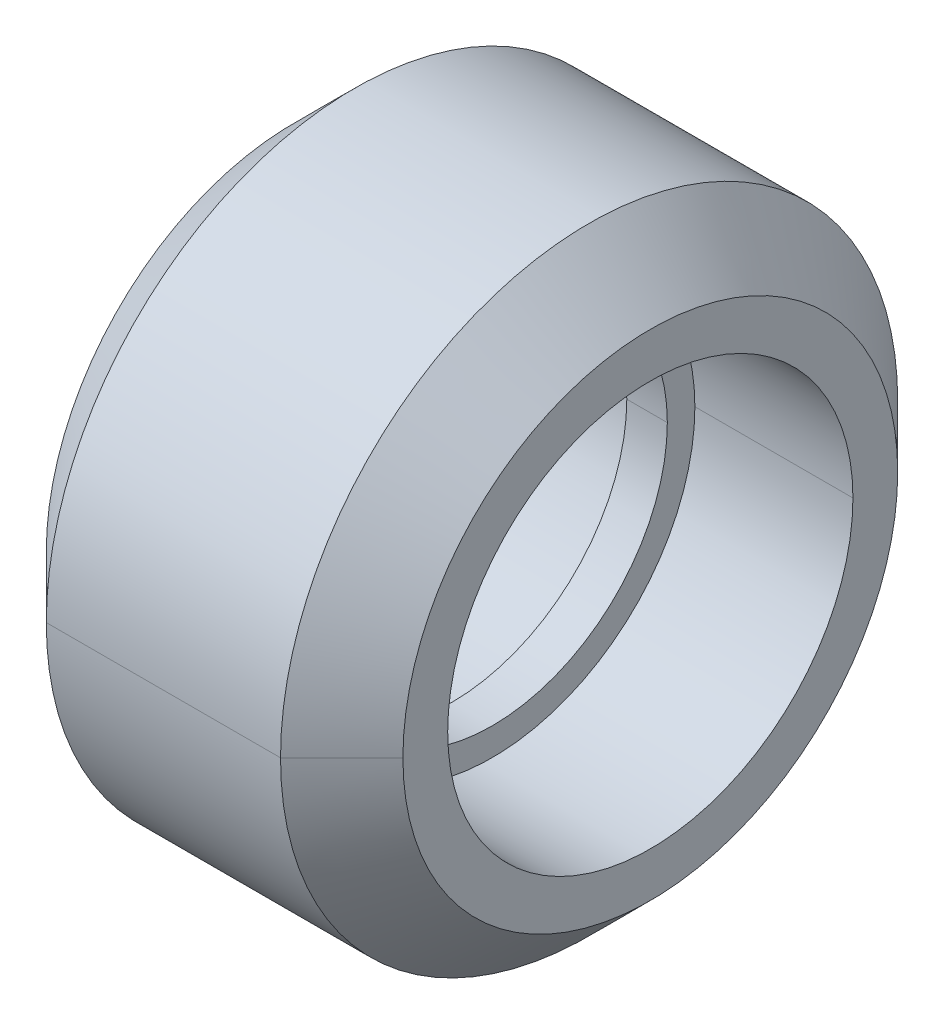
ISO-10303-21;
HEADER;
FILE_DESCRIPTION(('STEP AP214'),'2;1');
FILE_NAME('part.step','',(''),(''),'','','');
FILE_SCHEMA(('AUTOMOTIVE_DESIGN { 1 0 10303 214 1 1 1 1 }'));
ENDSEC;
DATA;
#1=APPLICATION_CONTEXT('core data for automotive mechanical design processes');
#2=APPLICATION_PROTOCOL_DEFINITION('international standard','automotive_design',2000,#1);
#3=PRODUCT_CONTEXT('',#1,'mechanical');
#4=PRODUCT('Part','Part','',(#3));
#5=PRODUCT_RELATED_PRODUCT_CATEGORY('part','',(#4));
#6=PRODUCT_DEFINITION_FORMATION('','',#4);
#7=PRODUCT_DEFINITION_CONTEXT('part definition',#1,'design');
#8=PRODUCT_DEFINITION('design','',#6,#7);
#9=PRODUCT_DEFINITION_SHAPE('','',#8);
#10=(LENGTH_UNIT() NAMED_UNIT(*) SI_UNIT(.MILLI.,.METRE.));
#11=(NAMED_UNIT(*) PLANE_ANGLE_UNIT() SI_UNIT($,.RADIAN.));
#12=(NAMED_UNIT(*) SI_UNIT($,.STERADIAN.) SOLID_ANGLE_UNIT());
#13=UNCERTAINTY_MEASURE_WITH_UNIT(LENGTH_MEASURE(1.E-05),#10,'distance_accuracy_value','');
#14=(GEOMETRIC_REPRESENTATION_CONTEXT(3) GLOBAL_UNCERTAINTY_ASSIGNED_CONTEXT((#13)) GLOBAL_UNIT_ASSIGNED_CONTEXT((#10,
#11,#12)) REPRESENTATION_CONTEXT('',''));
#15=CARTESIAN_POINT('',(0.,0.,0.));
#16=DIRECTION('',(0.,0.,1.));
#17=DIRECTION('',(1.,0.,0.));
#18=AXIS2_PLACEMENT_3D('',#15,#16,#17);
#19=CARTESIAN_POINT('',(0.,0.,0.));
#20=DIRECTION('',(1.,0.,0.));
#21=DIRECTION('',(0.,0.,-1.));
#22=AXIS2_PLACEMENT_3D('',#19,#20,#21);
#23=CYLINDRICAL_SURFACE('',#22,5.);
#24=DIRECTION('',(1.,0.,0.));
#25=VECTOR('',#24,1.);
#26=CARTESIAN_POINT('',(0.,0.,5.));
#27=LINE('',#26,#25);
#28=CARTESIAN_POINT('',(-4.4,0.,5.));
#29=VERTEX_POINT('',#28);
#30=CARTESIAN_POINT('',(-0.5,0.,5.));
#31=VERTEX_POINT('',#30);
#32=EDGE_CURVE('E176',#29,#31,#27,.T.);
#33=ORIENTED_EDGE('',*,*,#32,.F.);
#34=CARTESIAN_POINT('',(-4.4,0.,0.));
#35=DIRECTION('',(1.,0.,0.));
#36=DIRECTION('',(0.,0.,-1.));
#37=AXIS2_PLACEMENT_3D('',#34,#35,#36);
#38=CIRCLE('',#37,5.);
#39=CARTESIAN_POINT('',(-4.4,0.,-5.));
#40=VERTEX_POINT('',#39);
#41=EDGE_CURVE('E10',#40,#29,#38,.T.);
#42=ORIENTED_EDGE('',*,*,#41,.F.);
#43=DIRECTION('',(1.,0.,0.));
#44=VECTOR('',#43,1.);
#45=CARTESIAN_POINT('',(0.,0.,-5.));
#46=LINE('',#45,#44);
#47=CARTESIAN_POINT('',(-0.5,0.,-5.));
#48=VERTEX_POINT('',#47);
#49=EDGE_CURVE('E566',#40,#48,#46,.T.);
#50=ORIENTED_EDGE('',*,*,#49,.T.);
#51=CARTESIAN_POINT('',(-0.5,0.,0.));
#52=DIRECTION('',(1.,0.,0.));
#53=DIRECTION('',(0.,0.,-1.));
#54=AXIS2_PLACEMENT_3D('',#51,#52,#53);
#55=CIRCLE('',#54,5.);
#56=EDGE_CURVE('E69',#48,#31,#55,.T.);
#57=ORIENTED_EDGE('',*,*,#56,.T.);
#58=EDGE_LOOP('',(#33,#42,#50,#57));
#59=FACE_BOUND('',#58,.T.);
#60=ADVANCED_FACE('F15',(#59),#23,.F.);
#61=CARTESIAN_POINT('',(-4.4,5.,0.));
#62=DIRECTION('',(-1.,0.,0.));
#63=DIRECTION('',(0.,0.,1.));
#64=AXIS2_PLACEMENT_3D('',#61,#62,#63);
#65=PLANE('',#64);
#66=ORIENTED_EDGE('',*,*,#41,.T.);
#67=CARTESIAN_POINT('',(-4.4,0.,0.));
#68=DIRECTION('',(1.,0.,0.));
#69=DIRECTION('',(0.,0.,-1.));
#70=AXIS2_PLACEMENT_3D('',#67,#68,#69);
#71=CIRCLE('',#70,5.);
#72=EDGE_CURVE('E173',#29,#40,#71,.T.);
#73=ORIENTED_EDGE('',*,*,#72,.T.);
#74=EDGE_LOOP('',(#66,#73));
#75=FACE_BOUND('',#74,.T.);
#76=CARTESIAN_POINT('',(-4.4,0.,0.));
#77=DIRECTION('',(1.,0.,0.));
#78=DIRECTION('',(0.,0.,-1.));
#79=AXIS2_PLACEMENT_3D('',#76,#77,#78);
#80=CIRCLE('',#79,6.105);
#81=CARTESIAN_POINT('',(-4.4,0.,-6.105));
#82=VERTEX_POINT('',#81);
#83=CARTESIAN_POINT('',(-4.4,0.,6.105));
#84=VERTEX_POINT('',#83);
#85=EDGE_CURVE('E210',#82,#84,#80,.T.);
#86=ORIENTED_EDGE('',*,*,#85,.F.);
#87=CARTESIAN_POINT('',(-4.4,0.,0.));
#88=DIRECTION('',(1.,0.,0.));
#89=DIRECTION('',(0.,0.,-1.));
#90=AXIS2_PLACEMENT_3D('',#87,#88,#89);
#91=CIRCLE('',#90,6.105);
#92=EDGE_CURVE('E26',#84,#82,#91,.T.);
#93=ORIENTED_EDGE('',*,*,#92,.F.);
#94=EDGE_LOOP('',(#86,#93));
#95=FACE_BOUND('',#94,.T.);
#96=ADVANCED_FACE('F269',(#75,#95),#65,.T.);
#97=CARTESIAN_POINT('',(-2.89,0.,0.));
#98=DIRECTION('',(1.,0.,0.));
#99=DIRECTION('',(0.,0.,-1.));
#100=AXIS2_PLACEMENT_3D('',#97,#98,#99);
#101=CONICAL_SURFACE('',#100,7.615,0.785398163397447);
#102=DIRECTION('',(0.707106781186549,0.,0.707106781186546));
#103=VECTOR('',#102,1.);
#104=CARTESIAN_POINT('',(-2.89,0.,7.615));
#105=LINE('',#104,#103);
#106=CARTESIAN_POINT('',(-2.89,0.,7.615));
#107=VERTEX_POINT('',#106);
#108=EDGE_CURVE('E206',#84,#107,#105,.T.);
#109=ORIENTED_EDGE('',*,*,#108,.F.);
#110=ORIENTED_EDGE('',*,*,#92,.T.);
#111=DIRECTION('',(0.707106781186549,0.,-0.707106781186546));
#112=VECTOR('',#111,1.);
#113=CARTESIAN_POINT('',(-2.89,0.,-7.615));
#114=LINE('',#113,#112);
#115=CARTESIAN_POINT('',(-2.89,0.,-7.615));
#116=VERTEX_POINT('',#115);
#117=EDGE_CURVE('E218',#82,#116,#114,.T.);
#118=ORIENTED_EDGE('',*,*,#117,.T.);
#119=CARTESIAN_POINT('',(-2.89,0.,0.));
#120=DIRECTION('',(1.,0.,0.));
#121=DIRECTION('',(0.,0.,-1.));
#122=AXIS2_PLACEMENT_3D('',#119,#120,#121);
#123=CIRCLE('',#122,7.615);
#124=EDGE_CURVE('E192',#107,#116,#123,.T.);
#125=ORIENTED_EDGE('',*,*,#124,.F.);
#126=EDGE_LOOP('',(#109,#110,#118,#125));
#127=FACE_BOUND('',#126,.T.);
#128=ADVANCED_FACE('F274',(#127),#101,.T.);
#129=CARTESIAN_POINT('',(0.,0.,0.));
#130=DIRECTION('',(1.,0.,0.));
#131=DIRECTION('',(0.,0.,-1.));
#132=AXIS2_PLACEMENT_3D('',#129,#130,#131);
#133=CYLINDRICAL_SURFACE('',#132,7.615);
#134=DIRECTION('',(1.,0.,0.));
#135=VECTOR('',#134,1.);
#136=CARTESIAN_POINT('',(0.,0.,7.615));
#137=LINE('',#136,#135);
#138=CARTESIAN_POINT('',(2.89,0.,7.615));
#139=VERTEX_POINT('',#138);
#140=EDGE_CURVE('E196',#107,#139,#137,.T.);
#141=ORIENTED_EDGE('',*,*,#140,.F.);
#142=ORIENTED_EDGE('',*,*,#124,.T.);
#143=DIRECTION('',(1.,0.,0.));
#144=VECTOR('',#143,1.);
#145=CARTESIAN_POINT('',(0.,0.,-7.615));
#146=LINE('',#145,#144);
#147=CARTESIAN_POINT('',(2.89,0.,-7.615));
#148=VERTEX_POINT('',#147);
#149=EDGE_CURVE('E177',#116,#148,#146,.T.);
#150=ORIENTED_EDGE('',*,*,#149,.T.);
#151=CARTESIAN_POINT('',(2.89,0.,0.));
#152=DIRECTION('',(1.,0.,0.));
#153=DIRECTION('',(0.,0.,-1.));
#154=AXIS2_PLACEMENT_3D('',#151,#152,#153);
#155=CIRCLE('',#154,7.615);
#156=EDGE_CURVE('E185',#139,#148,#155,.T.);
#157=ORIENTED_EDGE('',*,*,#156,.F.);
#158=EDGE_LOOP('',(#141,#142,#150,#157));
#159=FACE_BOUND('',#158,.T.);
#160=ADVANCED_FACE('F287',(#159),#133,.T.);
#161=CARTESIAN_POINT('',(4.4,0.,0.));
#162=DIRECTION('',(-1.,0.,0.));
#163=DIRECTION('',(0.,0.,1.));
#164=AXIS2_PLACEMENT_3D('',#161,#162,#163);
#165=CONICAL_SURFACE('',#164,6.105,0.785398163397447);
#166=DIRECTION('',(-0.707106781186549,0.,-0.707106781186546));
#167=VECTOR('',#166,1.);
#168=CARTESIAN_POINT('',(4.4,0.,-6.105));
#169=LINE('',#168,#167);
#170=CARTESIAN_POINT('',(4.4,0.,-6.105));
#171=VERTEX_POINT('',#170);
#172=EDGE_CURVE('E215',#171,#148,#169,.T.);
#173=ORIENTED_EDGE('',*,*,#172,.F.);
#174=CARTESIAN_POINT('',(4.4,0.,0.));
#175=DIRECTION('',(1.,0.,0.));
#176=DIRECTION('',(0.,0.,-1.));
#177=AXIS2_PLACEMENT_3D('',#174,#175,#176);
#178=CIRCLE('',#177,6.105);
#179=CARTESIAN_POINT('',(4.4,0.,6.105));
#180=VERTEX_POINT('',#179);
#181=EDGE_CURVE('E106',#180,#171,#178,.T.);
#182=ORIENTED_EDGE('',*,*,#181,.F.);
#183=DIRECTION('',(-0.707106781186549,0.,0.707106781186546));
#184=VECTOR('',#183,1.);
#185=CARTESIAN_POINT('',(4.4,0.,6.105));
#186=LINE('',#185,#184);
#187=EDGE_CURVE('E19',#180,#139,#186,.T.);
#188=ORIENTED_EDGE('',*,*,#187,.T.);
#189=ORIENTED_EDGE('',*,*,#156,.T.);
#190=EDGE_LOOP('',(#173,#182,#188,#189));
#191=FACE_BOUND('',#190,.T.);
#192=ADVANCED_FACE('F17',(#191),#165,.T.);
#193=CARTESIAN_POINT('',(4.4,5.,0.));
#194=DIRECTION('',(1.,0.,0.));
#195=DIRECTION('',(0.,1.,0.));
#196=AXIS2_PLACEMENT_3D('',#193,#194,#195);
#197=PLANE('',#196);
#198=CARTESIAN_POINT('',(4.4,0.,0.));
#199=DIRECTION('',(1.,0.,0.));
#200=DIRECTION('',(0.,0.,-1.));
#201=AXIS2_PLACEMENT_3D('',#198,#199,#200);
#202=CIRCLE('',#201,5.);
#203=CARTESIAN_POINT('',(4.4,0.,-5.));
#204=VERTEX_POINT('',#203);
#205=CARTESIAN_POINT('',(4.4,0.,5.));
#206=VERTEX_POINT('',#205);
#207=EDGE_CURVE('E122',#204,#206,#202,.T.);
#208=ORIENTED_EDGE('',*,*,#207,.F.);
#209=CARTESIAN_POINT('',(4.4,0.,0.));
#210=DIRECTION('',(1.,0.,0.));
#211=DIRECTION('',(0.,0.,-1.));
#212=AXIS2_PLACEMENT_3D('',#209,#210,#211);
#213=CIRCLE('',#212,5.);
#214=EDGE_CURVE('E169',#206,#204,#213,.T.);
#215=ORIENTED_EDGE('',*,*,#214,.F.);
#216=EDGE_LOOP('',(#208,#215));
#217=FACE_BOUND('',#216,.T.);
#218=ORIENTED_EDGE('',*,*,#181,.T.);
#219=CARTESIAN_POINT('',(4.4,0.,0.));
#220=DIRECTION('',(1.,0.,0.));
#221=DIRECTION('',(0.,0.,-1.));
#222=AXIS2_PLACEMENT_3D('',#219,#220,#221);
#223=CIRCLE('',#222,6.105);
#224=EDGE_CURVE('E181',#171,#180,#223,.T.);
#225=ORIENTED_EDGE('',*,*,#224,.T.);
#226=EDGE_LOOP('',(#218,#225));
#227=FACE_BOUND('',#226,.T.);
#228=ADVANCED_FACE('F265',(#217,#227),#197,.T.);
#229=CARTESIAN_POINT('',(0.,0.,0.));
#230=DIRECTION('',(1.,0.,0.));
#231=DIRECTION('',(0.,0.,-1.));
#232=AXIS2_PLACEMENT_3D('',#229,#230,#231);
#233=CYLINDRICAL_SURFACE('',#232,5.);
#234=DIRECTION('',(1.,0.,0.));
#235=VECTOR('',#234,1.);
#236=CARTESIAN_POINT('',(0.,0.,5.));
#237=LINE('',#236,#235);
#238=CARTESIAN_POINT('',(0.5,0.,5.));
#239=VERTEX_POINT('',#238);
#240=EDGE_CURVE('E200',#239,#206,#237,.T.);
#241=ORIENTED_EDGE('',*,*,#240,.F.);
#242=CARTESIAN_POINT('',(0.5,0.,0.));
#243=DIRECTION('',(1.,0.,0.));
#244=DIRECTION('',(0.,0.,-1.));
#245=AXIS2_PLACEMENT_3D('',#242,#243,#244);
#246=CIRCLE('',#245,5.);
#247=CARTESIAN_POINT('',(0.5,0.,-5.));
#248=VERTEX_POINT('',#247);
#249=EDGE_CURVE('E91',#248,#239,#246,.T.);
#250=ORIENTED_EDGE('',*,*,#249,.F.);
#251=DIRECTION('',(1.,0.,0.));
#252=VECTOR('',#251,1.);
#253=CARTESIAN_POINT('',(0.,0.,-5.));
#254=LINE('',#253,#252);
#255=EDGE_CURVE('E161',#248,#204,#254,.T.);
#256=ORIENTED_EDGE('',*,*,#255,.T.);
#257=ORIENTED_EDGE('',*,*,#207,.T.);
#258=EDGE_LOOP('',(#241,#250,#256,#257));
#259=FACE_BOUND('',#258,.T.);
#260=ADVANCED_FACE('F256',(#259),#233,.F.);
#261=CARTESIAN_POINT('',(0.5,4.32,0.));
#262=DIRECTION('',(1.,0.,0.));
#263=DIRECTION('',(0.,1.,0.));
#264=AXIS2_PLACEMENT_3D('',#261,#262,#263);
#265=PLANE('',#264);
#266=CARTESIAN_POINT('',(0.5,0.,0.));
#267=DIRECTION('',(1.,0.,0.));
#268=DIRECTION('',(0.,0.,-1.));
#269=AXIS2_PLACEMENT_3D('',#266,#267,#268);
#270=CIRCLE('',#269,4.32);
#271=CARTESIAN_POINT('',(0.5,0.,-4.32));
#272=VERTEX_POINT('',#271);
#273=CARTESIAN_POINT('',(0.5,0.,4.32));
#274=VERTEX_POINT('',#273);
#275=EDGE_CURVE('E40',#272,#274,#270,.T.);
#276=ORIENTED_EDGE('',*,*,#275,.F.);
#277=CARTESIAN_POINT('',(0.5,0.,0.));
#278=DIRECTION('',(1.,0.,0.));
#279=DIRECTION('',(0.,0.,-1.));
#280=AXIS2_PLACEMENT_3D('',#277,#278,#279);
#281=CIRCLE('',#280,4.32);
#282=EDGE_CURVE('E156',#274,#272,#281,.T.);
#283=ORIENTED_EDGE('',*,*,#282,.F.);
#284=EDGE_LOOP('',(#276,#283));
#285=FACE_BOUND('',#284,.T.);
#286=ORIENTED_EDGE('',*,*,#249,.T.);
#287=CARTESIAN_POINT('',(0.5,0.,0.));
#288=DIRECTION('',(1.,0.,0.));
#289=DIRECTION('',(0.,0.,-1.));
#290=AXIS2_PLACEMENT_3D('',#287,#288,#289);
#291=CIRCLE('',#290,5.);
#292=EDGE_CURVE('E197',#239,#248,#291,.T.);
#293=ORIENTED_EDGE('',*,*,#292,.T.);
#294=EDGE_LOOP('',(#286,#293));
#295=FACE_BOUND('',#294,.T.);
#296=ADVANCED_FACE('F257',(#285,#295),#265,.T.);
#297=CARTESIAN_POINT('',(0.,0.,0.));
#298=DIRECTION('',(1.,0.,0.));
#299=DIRECTION('',(0.,0.,-1.));
#300=AXIS2_PLACEMENT_3D('',#297,#298,#299);
#301=CYLINDRICAL_SURFACE('',#300,4.32);
#302=DIRECTION('',(1.,0.,0.));
#303=VECTOR('',#302,1.);
#304=CARTESIAN_POINT('',(0.,0.,4.32));
#305=LINE('',#304,#303);
#306=CARTESIAN_POINT('',(-0.5,0.,4.32));
#307=VERTEX_POINT('',#306);
#308=EDGE_CURVE('E147',#307,#274,#305,.T.);
#309=ORIENTED_EDGE('',*,*,#308,.F.);
#310=CARTESIAN_POINT('',(-0.5,0.,0.));
#311=DIRECTION('',(1.,0.,0.));
#312=DIRECTION('',(0.,0.,-1.));
#313=AXIS2_PLACEMENT_3D('',#310,#311,#312);
#314=CIRCLE('',#313,4.32);
#315=CARTESIAN_POINT('',(-0.5,0.,-4.32));
#316=VERTEX_POINT('',#315);
#317=EDGE_CURVE('E141',#316,#307,#314,.T.);
#318=ORIENTED_EDGE('',*,*,#317,.F.);
#319=DIRECTION('',(1.,0.,0.));
#320=VECTOR('',#319,1.);
#321=CARTESIAN_POINT('',(0.,0.,-4.32));
#322=LINE('',#321,#320);
#323=EDGE_CURVE('E144',#316,#272,#322,.T.);
#324=ORIENTED_EDGE('',*,*,#323,.T.);
#325=ORIENTED_EDGE('',*,*,#275,.T.);
#326=EDGE_LOOP('',(#309,#318,#324,#325));
#327=FACE_BOUND('',#326,.T.);
#328=ADVANCED_FACE('F143',(#327),#301,.F.);
#329=CARTESIAN_POINT('',(-0.5,4.32,0.));
#330=DIRECTION('',(-1.,0.,0.));
#331=DIRECTION('',(0.,0.,1.));
#332=AXIS2_PLACEMENT_3D('',#329,#330,#331);
#333=PLANE('',#332);
#334=ORIENTED_EDGE('',*,*,#317,.T.);
#335=CARTESIAN_POINT('',(-0.5,0.,0.));
#336=DIRECTION('',(1.,0.,0.));
#337=DIRECTION('',(0.,0.,-1.));
#338=AXIS2_PLACEMENT_3D('',#335,#336,#337);
#339=CIRCLE('',#338,4.32);
#340=EDGE_CURVE('E155',#307,#316,#339,.T.);
#341=ORIENTED_EDGE('',*,*,#340,.T.);
#342=EDGE_LOOP('',(#334,#341));
#343=FACE_BOUND('',#342,.T.);
#344=ORIENTED_EDGE('',*,*,#56,.F.);
#345=CARTESIAN_POINT('',(-0.5,0.,0.));
#346=DIRECTION('',(1.,0.,0.));
#347=DIRECTION('',(0.,0.,-1.));
#348=AXIS2_PLACEMENT_3D('',#345,#346,#347);
#349=CIRCLE('',#348,5.);
#350=EDGE_CURVE('E247',#31,#48,#349,.T.);
#351=ORIENTED_EDGE('',*,*,#350,.F.);
#352=EDGE_LOOP('',(#344,#351));
#353=FACE_BOUND('',#352,.T.);
#354=ADVANCED_FACE('F159',(#343,#353),#333,.T.);
#355=CARTESIAN_POINT('',(0.,0.,0.));
#356=DIRECTION('',(1.,0.,0.));
#357=DIRECTION('',(0.,0.,-1.));
#358=AXIS2_PLACEMENT_3D('',#355,#356,#357);
#359=CYLINDRICAL_SURFACE('',#358,4.32);
#360=ORIENTED_EDGE('',*,*,#340,.F.);
#361=ORIENTED_EDGE('',*,*,#308,.T.);
#362=ORIENTED_EDGE('',*,*,#282,.T.);
#363=ORIENTED_EDGE('',*,*,#323,.F.);
#364=EDGE_LOOP('',(#360,#361,#362,#363));
#365=FACE_BOUND('',#364,.T.);
#366=ADVANCED_FACE('F154',(#365),#359,.F.);
#367=CARTESIAN_POINT('',(0.,0.,0.));
#368=DIRECTION('',(1.,0.,0.));
#369=DIRECTION('',(0.,0.,-1.));
#370=AXIS2_PLACEMENT_3D('',#367,#368,#369);
#371=CYLINDRICAL_SURFACE('',#370,5.);
#372=ORIENTED_EDGE('',*,*,#292,.F.);
#373=ORIENTED_EDGE('',*,*,#240,.T.);
#374=ORIENTED_EDGE('',*,*,#214,.T.);
#375=ORIENTED_EDGE('',*,*,#255,.F.);
#376=EDGE_LOOP('',(#372,#373,#374,#375));
#377=FACE_BOUND('',#376,.T.);
#378=ADVANCED_FACE('F254',(#377),#371,.F.);
#379=CARTESIAN_POINT('',(4.4,0.,0.));
#380=DIRECTION('',(-1.,0.,0.));
#381=DIRECTION('',(0.,0.,1.));
#382=AXIS2_PLACEMENT_3D('',#379,#380,#381);
#383=CONICAL_SURFACE('',#382,6.105,0.785398163397447);
#384=ORIENTED_EDGE('',*,*,#224,.F.);
#385=ORIENTED_EDGE('',*,*,#172,.T.);
#386=CARTESIAN_POINT('',(2.89,0.,0.));
#387=DIRECTION('',(1.,0.,0.));
#388=DIRECTION('',(0.,0.,-1.));
#389=AXIS2_PLACEMENT_3D('',#386,#387,#388);
#390=CIRCLE('',#389,7.615);
#391=EDGE_CURVE('E182',#148,#139,#390,.T.);
#392=ORIENTED_EDGE('',*,*,#391,.T.);
#393=ORIENTED_EDGE('',*,*,#187,.F.);
#394=EDGE_LOOP('',(#384,#385,#392,#393));
#395=FACE_BOUND('',#394,.T.);
#396=ADVANCED_FACE('F278',(#395),#383,.T.);
#397=CARTESIAN_POINT('',(0.,0.,0.));
#398=DIRECTION('',(1.,0.,0.));
#399=DIRECTION('',(0.,0.,-1.));
#400=AXIS2_PLACEMENT_3D('',#397,#398,#399);
#401=CYLINDRICAL_SURFACE('',#400,7.615);
#402=CARTESIAN_POINT('',(-2.89,0.,0.));
#403=DIRECTION('',(1.,0.,0.));
#404=DIRECTION('',(0.,0.,-1.));
#405=AXIS2_PLACEMENT_3D('',#402,#403,#404);
#406=CIRCLE('',#405,7.615);
#407=EDGE_CURVE('E209',#116,#107,#406,.T.);
#408=ORIENTED_EDGE('',*,*,#407,.T.);
#409=ORIENTED_EDGE('',*,*,#140,.T.);
#410=ORIENTED_EDGE('',*,*,#391,.F.);
#411=ORIENTED_EDGE('',*,*,#149,.F.);
#412=EDGE_LOOP('',(#408,#409,#410,#411));
#413=FACE_BOUND('',#412,.T.);
#414=ADVANCED_FACE('F281',(#413),#401,.T.);
#415=CARTESIAN_POINT('',(-2.89,0.,0.));
#416=DIRECTION('',(1.,0.,0.));
#417=DIRECTION('',(0.,0.,-1.));
#418=AXIS2_PLACEMENT_3D('',#415,#416,#417);
#419=CONICAL_SURFACE('',#418,7.615,0.785398163397447);
#420=ORIENTED_EDGE('',*,*,#85,.T.);
#421=ORIENTED_EDGE('',*,*,#108,.T.);
#422=ORIENTED_EDGE('',*,*,#407,.F.);
#423=ORIENTED_EDGE('',*,*,#117,.F.);
#424=EDGE_LOOP('',(#420,#421,#422,#423));
#425=FACE_BOUND('',#424,.T.);
#426=ADVANCED_FACE('F284',(#425),#419,.T.);
#427=CARTESIAN_POINT('',(0.,0.,0.));
#428=DIRECTION('',(1.,0.,0.));
#429=DIRECTION('',(0.,0.,-1.));
#430=AXIS2_PLACEMENT_3D('',#427,#428,#429);
#431=CYLINDRICAL_SURFACE('',#430,5.);
#432=ORIENTED_EDGE('',*,*,#72,.F.);
#433=ORIENTED_EDGE('',*,*,#32,.T.);
#434=ORIENTED_EDGE('',*,*,#350,.T.);
#435=ORIENTED_EDGE('',*,*,#49,.F.);
#436=EDGE_LOOP('',(#432,#433,#434,#435));
#437=FACE_BOUND('',#436,.T.);
#438=ADVANCED_FACE('F297',(#437),#431,.F.);
#439=CLOSED_SHELL('',(#60,#96,#128,#160,#192,#228,#260,#296,#328,#354,#366,#378,#396,#414,#426,#438));
#440=MANIFOLD_SOLID_BREP('B1',#439);
#441=ADVANCED_BREP_SHAPE_REPRESENTATION('',(#18,#440),#14);
#442=SHAPE_DEFINITION_REPRESENTATION(#9,#441);
ENDSEC;
END-ISO-10303-21;
